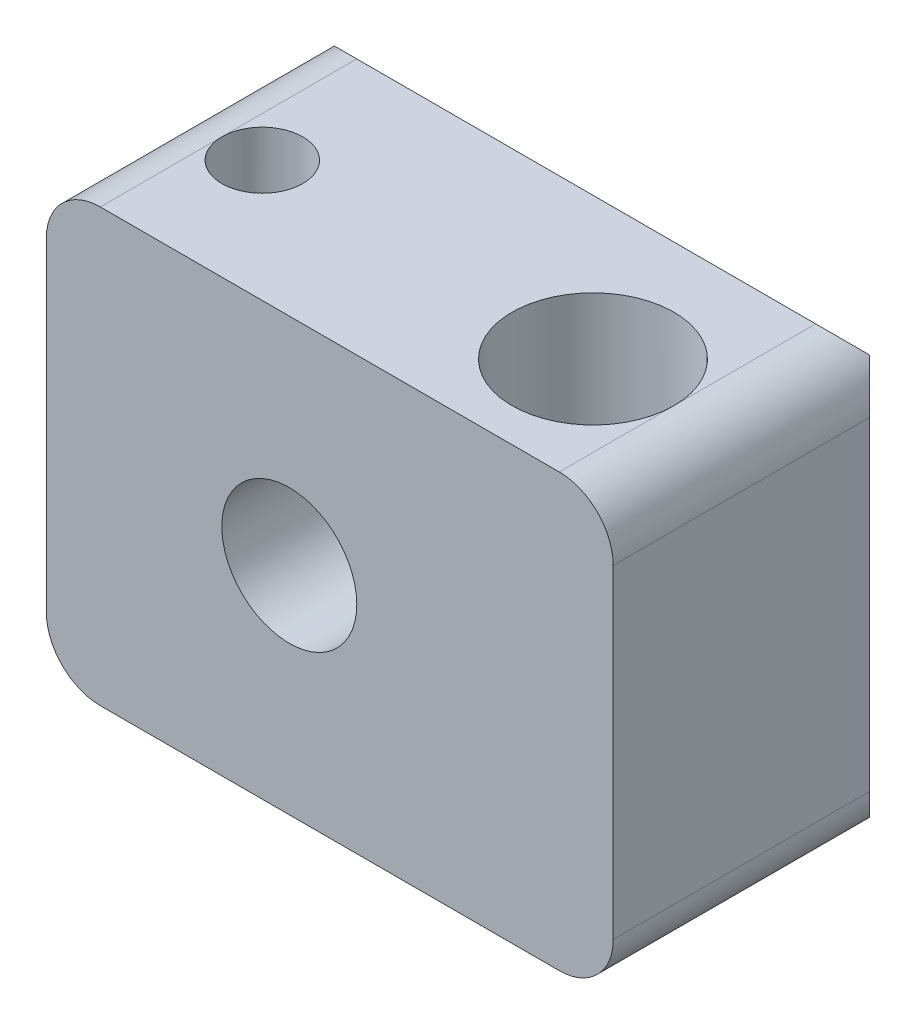
ISO-10303-21;
HEADER;
FILE_DESCRIPTION(('STEP AP214'),'2;1');
FILE_NAME('part.step','',(''),(''),'','','');
FILE_SCHEMA(('AUTOMOTIVE_DESIGN { 1 0 10303 214 1 1 1 1 }'));
ENDSEC;
DATA;
#1=APPLICATION_CONTEXT('core data for automotive mechanical design processes');
#2=APPLICATION_PROTOCOL_DEFINITION('international standard','automotive_design',2000,#1);
#3=PRODUCT_CONTEXT('',#1,'mechanical');
#4=PRODUCT('Part','Part','',(#3));
#5=PRODUCT_RELATED_PRODUCT_CATEGORY('part','',(#4));
#6=PRODUCT_DEFINITION_FORMATION('','',#4);
#7=PRODUCT_DEFINITION_CONTEXT('part definition',#1,'design');
#8=PRODUCT_DEFINITION('design','',#6,#7);
#9=PRODUCT_DEFINITION_SHAPE('','',#8);
#10=(LENGTH_UNIT() NAMED_UNIT(*) SI_UNIT(.MILLI.,.METRE.));
#11=(NAMED_UNIT(*) PLANE_ANGLE_UNIT() SI_UNIT($,.RADIAN.));
#12=(NAMED_UNIT(*) SI_UNIT($,.STERADIAN.) SOLID_ANGLE_UNIT());
#13=UNCERTAINTY_MEASURE_WITH_UNIT(LENGTH_MEASURE(1.E-05),#10,'distance_accuracy_value','');
#14=(GEOMETRIC_REPRESENTATION_CONTEXT(3) GLOBAL_UNCERTAINTY_ASSIGNED_CONTEXT((#13)) GLOBAL_UNIT_ASSIGNED_CONTEXT((#10,
#11,#12)) REPRESENTATION_CONTEXT('',''));
#15=CARTESIAN_POINT('',(0.,0.,0.));
#16=DIRECTION('',(0.,0.,1.));
#17=DIRECTION('',(1.,0.,0.));
#18=AXIS2_PLACEMENT_3D('',#15,#16,#17);
#19=CARTESIAN_POINT('',(-10.5,8.,11.5));
#20=DIRECTION('',(-1.,0.,0.));
#21=DIRECTION('',(0.,-1.,0.));
#22=AXIS2_PLACEMENT_3D('',#19,#20,#21);
#23=PLANE('',#22);
#24=DIRECTION('',(0.,-1.,0.));
#25=VECTOR('',#24,1.);
#26=CARTESIAN_POINT('',(-10.5,8.,2.00000000000001));
#27=LINE('',#26,#25);
#28=CARTESIAN_POINT('',(-10.5,6.,2.00000000000001));
#29=VERTEX_POINT('',#28);
#30=CARTESIAN_POINT('',(-10.5,-6.,2.00000000000001));
#31=VERTEX_POINT('',#30);
#32=EDGE_CURVE('E174',#29,#31,#27,.T.);
#33=ORIENTED_EDGE('',*,*,#32,.T.);
#34=DIRECTION('',(0.,0.,-1.));
#35=VECTOR('',#34,1.);
#36=CARTESIAN_POINT('',(-10.5,-6.,11.5));
#37=LINE('',#36,#35);
#38=CARTESIAN_POINT('',(-10.5,-6.,11.5));
#39=VERTEX_POINT('',#38);
#40=EDGE_CURVE('E11',#31,#39,#37,.F.);
#41=ORIENTED_EDGE('',*,*,#40,.T.);
#42=DIRECTION('',(0.,1.,0.));
#43=VECTOR('',#42,1.);
#44=CARTESIAN_POINT('',(-10.5,8.,11.5));
#45=LINE('',#44,#43);
#46=CARTESIAN_POINT('',(-10.5,6.,11.5));
#47=VERTEX_POINT('',#46);
#48=EDGE_CURVE('E231',#39,#47,#45,.T.);
#49=ORIENTED_EDGE('',*,*,#48,.T.);
#50=DIRECTION('',(0.,0.,-1.));
#51=VECTOR('',#50,1.);
#52=CARTESIAN_POINT('',(-10.5,6.,11.5));
#53=LINE('',#52,#51);
#54=EDGE_CURVE('E40',#47,#29,#53,.T.);
#55=ORIENTED_EDGE('',*,*,#54,.T.);
#56=EDGE_LOOP('',(#33,#41,#49,#55));
#57=FACE_BOUND('',#56,.T.);
#58=ADVANCED_FACE('F32',(#57),#23,.T.);
#59=CARTESIAN_POINT('',(10.5,-8.,11.5));
#60=DIRECTION('',(0.,-1.,0.));
#61=DIRECTION('',(0.,0.,-1.));
#62=AXIS2_PLACEMENT_3D('',#59,#60,#61);
#63=PLANE('',#62);
#64=DIRECTION('',(1.,0.,0.));
#65=VECTOR('',#64,1.);
#66=CARTESIAN_POINT('',(10.5,-8.,2.00000000000001));
#67=LINE('',#66,#65);
#68=CARTESIAN_POINT('',(-8.49999999999999,-8.,2.00000000000001));
#69=VERTEX_POINT('',#68);
#70=CARTESIAN_POINT('',(8.49999999999999,-8.,2.00000000000001));
#71=VERTEX_POINT('',#70);
#72=EDGE_CURVE('E171',#69,#71,#67,.T.);
#73=ORIENTED_EDGE('',*,*,#72,.T.);
#74=DIRECTION('',(0.,0.,-1.));
#75=VECTOR('',#74,1.);
#76=CARTESIAN_POINT('',(8.49999999999999,-8.,11.5));
#77=LINE('',#76,#75);
#78=CARTESIAN_POINT('',(8.49999999999999,-8.00000000000001,7.25));
#79=VERTEX_POINT('',#78);
#80=EDGE_CURVE('E224',#71,#79,#77,.F.);
#81=ORIENTED_EDGE('',*,*,#80,.T.);
#82=CARTESIAN_POINT('',(5.49999999999999,-8.00000000000001,7.25));
#83=DIRECTION('',(0.,1.,0.));
#84=DIRECTION('',(0.,0.,1.));
#85=AXIS2_PLACEMENT_3D('',#82,#83,#84);
#86=CIRCLE('',#85,3.);
#87=EDGE_CURVE('E255',#79,#79,#86,.T.);
#88=ORIENTED_EDGE('',*,*,#87,.T.);
#89=DIRECTION('',(0.,0.,-1.));
#90=VECTOR('',#89,1.);
#91=CARTESIAN_POINT('',(8.49999999999999,-8.,11.5));
#92=LINE('',#91,#90);
#93=CARTESIAN_POINT('',(8.49999999999999,-8.,11.5));
#94=VERTEX_POINT('',#93);
#95=EDGE_CURVE('E222',#79,#94,#92,.F.);
#96=ORIENTED_EDGE('',*,*,#95,.T.);
#97=DIRECTION('',(-1.,0.,0.));
#98=VECTOR('',#97,1.);
#99=CARTESIAN_POINT('',(10.5,-8.,11.5));
#100=LINE('',#99,#98);
#101=CARTESIAN_POINT('',(-8.49999999999999,-8.,11.5));
#102=VERTEX_POINT('',#101);
#103=EDGE_CURVE('E158',#94,#102,#100,.T.);
#104=ORIENTED_EDGE('',*,*,#103,.T.);
#105=DIRECTION('',(0.,0.,-1.));
#106=VECTOR('',#105,1.);
#107=CARTESIAN_POINT('',(-8.49999999999999,-8.,11.5));
#108=LINE('',#107,#106);
#109=CARTESIAN_POINT('',(-8.49999999999999,-7.99999999999999,7.));
#110=VERTEX_POINT('',#109);
#111=EDGE_CURVE('E219',#102,#110,#108,.T.);
#112=ORIENTED_EDGE('',*,*,#111,.T.);
#113=CARTESIAN_POINT('',(-7.,-7.99999999999999,7.));
#114=DIRECTION('',(0.,-1.,0.));
#115=DIRECTION('',(0.,0.,-1.));
#116=AXIS2_PLACEMENT_3D('',#113,#114,#115);
#117=CIRCLE('',#116,1.49999999999999);
#118=EDGE_CURVE('E295',#110,#110,#117,.T.);
#119=ORIENTED_EDGE('',*,*,#118,.F.);
#120=DIRECTION('',(0.,0.,-1.));
#121=VECTOR('',#120,1.);
#122=CARTESIAN_POINT('',(-8.49999999999999,-8.,11.5));
#123=LINE('',#122,#121);
#124=EDGE_CURVE('E217',#110,#69,#123,.T.);
#125=ORIENTED_EDGE('',*,*,#124,.T.);
#126=EDGE_LOOP('',(#73,#81,#88,#96,#104,#112,#119,#125));
#127=FACE_BOUND('',#126,.T.);
#128=ADVANCED_FACE('F324',(#127),#63,.T.);
#129=CARTESIAN_POINT('',(10.5,8.,11.5));
#130=DIRECTION('',(1.,0.,0.));
#131=DIRECTION('',(0.,1.,0.));
#132=AXIS2_PLACEMENT_3D('',#129,#130,#131);
#133=PLANE('',#132);
#134=DIRECTION('',(0.,1.,0.));
#135=VECTOR('',#134,1.);
#136=CARTESIAN_POINT('',(10.5,8.,2.00000000000001));
#137=LINE('',#136,#135);
#138=CARTESIAN_POINT('',(10.5,-6.,2.00000000000001));
#139=VERTEX_POINT('',#138);
#140=CARTESIAN_POINT('',(10.5,6.,2.00000000000001));
#141=VERTEX_POINT('',#140);
#142=EDGE_CURVE('E168',#139,#141,#137,.T.);
#143=ORIENTED_EDGE('',*,*,#142,.T.);
#144=DIRECTION('',(0.,0.,-1.));
#145=VECTOR('',#144,1.);
#146=CARTESIAN_POINT('',(10.5,6.,11.5));
#147=LINE('',#146,#145);
#148=CARTESIAN_POINT('',(10.5,6.,11.5));
#149=VERTEX_POINT('',#148);
#150=EDGE_CURVE('E203',#141,#149,#147,.F.);
#151=ORIENTED_EDGE('',*,*,#150,.T.);
#152=DIRECTION('',(0.,-1.,0.));
#153=VECTOR('',#152,1.);
#154=CARTESIAN_POINT('',(10.5,8.,11.5));
#155=LINE('',#154,#153);
#156=CARTESIAN_POINT('',(10.5,-6.,11.5));
#157=VERTEX_POINT('',#156);
#158=EDGE_CURVE('E161',#149,#157,#155,.T.);
#159=ORIENTED_EDGE('',*,*,#158,.T.);
#160=DIRECTION('',(0.,0.,-1.));
#161=VECTOR('',#160,1.);
#162=CARTESIAN_POINT('',(10.5,-6.,11.5));
#163=LINE('',#162,#161);
#164=EDGE_CURVE('E200',#157,#139,#163,.T.);
#165=ORIENTED_EDGE('',*,*,#164,.T.);
#166=EDGE_LOOP('',(#143,#151,#159,#165));
#167=FACE_BOUND('',#166,.T.);
#168=ADVANCED_FACE('F321',(#167),#133,.T.);
#169=CARTESIAN_POINT('',(-10.5,8.,11.5));
#170=DIRECTION('',(0.,1.,0.));
#171=DIRECTION('',(0.,0.,1.));
#172=AXIS2_PLACEMENT_3D('',#169,#170,#171);
#173=PLANE('',#172);
#174=DIRECTION('',(1.,0.,0.));
#175=VECTOR('',#174,1.);
#176=CARTESIAN_POINT('',(-10.5,8.,11.5));
#177=LINE('',#176,#175);
#178=CARTESIAN_POINT('',(-8.49999999999999,8.,11.5));
#179=VERTEX_POINT('',#178);
#180=CARTESIAN_POINT('',(8.49999999999999,8.,11.5));
#181=VERTEX_POINT('',#180);
#182=EDGE_CURVE('E241',#179,#181,#177,.T.);
#183=ORIENTED_EDGE('',*,*,#182,.T.);
#184=DIRECTION('',(0.,0.,-1.));
#185=VECTOR('',#184,1.);
#186=CARTESIAN_POINT('',(8.49999999999999,8.,11.5));
#187=LINE('',#186,#185);
#188=CARTESIAN_POINT('',(8.49999999999999,7.99999999999999,7.25));
#189=VERTEX_POINT('',#188);
#190=EDGE_CURVE('E189',#181,#189,#187,.T.);
#191=ORIENTED_EDGE('',*,*,#190,.T.);
#192=CARTESIAN_POINT('',(5.49999999999999,7.99999999999999,7.25));
#193=DIRECTION('',(0.,1.,0.));
#194=DIRECTION('',(0.,0.,1.));
#195=AXIS2_PLACEMENT_3D('',#192,#193,#194);
#196=CIRCLE('',#195,3.);
#197=EDGE_CURVE('E258',#189,#189,#196,.T.);
#198=ORIENTED_EDGE('',*,*,#197,.F.);
#199=DIRECTION('',(0.,0.,-1.));
#200=VECTOR('',#199,1.);
#201=CARTESIAN_POINT('',(8.49999999999999,8.,11.5));
#202=LINE('',#201,#200);
#203=CARTESIAN_POINT('',(8.49999999999999,8.,2.00000000000001));
#204=VERTEX_POINT('',#203);
#205=EDGE_CURVE('E187',#189,#204,#202,.T.);
#206=ORIENTED_EDGE('',*,*,#205,.T.);
#207=DIRECTION('',(-1.,0.,0.));
#208=VECTOR('',#207,1.);
#209=CARTESIAN_POINT('',(-10.5,8.,2.00000000000001));
#210=LINE('',#209,#208);
#211=CARTESIAN_POINT('',(-8.49999999999999,8.,2.00000000000001));
#212=VERTEX_POINT('',#211);
#213=EDGE_CURVE('E176',#204,#212,#210,.T.);
#214=ORIENTED_EDGE('',*,*,#213,.T.);
#215=DIRECTION('',(0.,0.,-1.));
#216=VECTOR('',#215,1.);
#217=CARTESIAN_POINT('',(-8.49999999999999,8.,11.5));
#218=LINE('',#217,#216);
#219=CARTESIAN_POINT('',(-8.49999999999999,8.00000000000002,7.));
#220=VERTEX_POINT('',#219);
#221=EDGE_CURVE('E185',#212,#220,#218,.F.);
#222=ORIENTED_EDGE('',*,*,#221,.T.);
#223=CARTESIAN_POINT('',(-7.,8.00000000000002,7.));
#224=DIRECTION('',(0.,-1.,0.));
#225=DIRECTION('',(0.,0.,-1.));
#226=AXIS2_PLACEMENT_3D('',#223,#224,#225);
#227=CIRCLE('',#226,1.49999999999999);
#228=EDGE_CURVE('E297',#220,#220,#227,.T.);
#229=ORIENTED_EDGE('',*,*,#228,.T.);
#230=DIRECTION('',(0.,0.,-1.));
#231=VECTOR('',#230,1.);
#232=CARTESIAN_POINT('',(-8.49999999999999,8.,11.5));
#233=LINE('',#232,#231);
#234=EDGE_CURVE('E179',#220,#179,#233,.F.);
#235=ORIENTED_EDGE('',*,*,#234,.T.);
#236=EDGE_LOOP('',(#183,#191,#198,#206,#214,#222,#229,#235));
#237=FACE_BOUND('',#236,.T.);
#238=ADVANCED_FACE('F316',(#237),#173,.T.);
#239=CARTESIAN_POINT('',(0.,0.,11.5));
#240=DIRECTION('',(0.,0.,-1.));
#241=DIRECTION('',(-1.,0.,0.));
#242=AXIS2_PLACEMENT_3D('',#239,#240,#241);
#243=PLANE('',#242);
#244=CARTESIAN_POINT('',(-1.50000000000001,0.,11.5));
#245=DIRECTION('',(0.,0.,1.));
#246=DIRECTION('',(1.,0.,0.));
#247=AXIS2_PLACEMENT_3D('',#244,#245,#246);
#248=CIRCLE('',#247,2.49999999999999);
#249=CARTESIAN_POINT('',(0.999999999999978,0.,11.5));
#250=VERTEX_POINT('',#249);
#251=EDGE_CURVE('E252',#250,#250,#248,.T.);
#252=ORIENTED_EDGE('',*,*,#251,.F.);
#253=EDGE_LOOP('',(#252));
#254=FACE_BOUND('',#253,.T.);
#255=ORIENTED_EDGE('',*,*,#158,.F.);
#256=CARTESIAN_POINT('',(8.49999999999999,6.,11.5));
#257=DIRECTION('',(0.,0.,-1.));
#258=DIRECTION('',(-1.,0.,0.));
#259=AXIS2_PLACEMENT_3D('',#256,#257,#258);
#260=CIRCLE('',#259,2.);
#261=EDGE_CURVE('E211',#149,#181,#260,.F.);
#262=ORIENTED_EDGE('',*,*,#261,.T.);
#263=ORIENTED_EDGE('',*,*,#182,.F.);
#264=CARTESIAN_POINT('',(-8.49999999999999,6.,11.5));
#265=DIRECTION('',(0.,0.,-1.));
#266=DIRECTION('',(-1.,0.,0.));
#267=AXIS2_PLACEMENT_3D('',#264,#265,#266);
#268=CIRCLE('',#267,2.);
#269=EDGE_CURVE('E205',#179,#47,#268,.F.);
#270=ORIENTED_EDGE('',*,*,#269,.T.);
#271=ORIENTED_EDGE('',*,*,#48,.F.);
#272=CARTESIAN_POINT('',(-8.49999999999999,-6.,11.5));
#273=DIRECTION('',(0.,0.,-1.));
#274=DIRECTION('',(-1.,0.,0.));
#275=AXIS2_PLACEMENT_3D('',#272,#273,#274);
#276=CIRCLE('',#275,2.);
#277=EDGE_CURVE('E207',#39,#102,#276,.F.);
#278=ORIENTED_EDGE('',*,*,#277,.T.);
#279=ORIENTED_EDGE('',*,*,#103,.F.);
#280=CARTESIAN_POINT('',(8.49999999999999,-6.,11.5));
#281=DIRECTION('',(0.,0.,-1.));
#282=DIRECTION('',(-1.,0.,0.));
#283=AXIS2_PLACEMENT_3D('',#280,#281,#282);
#284=CIRCLE('',#283,2.);
#285=EDGE_CURVE('E209',#94,#157,#284,.F.);
#286=ORIENTED_EDGE('',*,*,#285,.T.);
#287=EDGE_LOOP('',(#255,#262,#263,#270,#271,#278,#279,#286));
#288=FACE_BOUND('',#287,.T.);
#289=ADVANCED_FACE('F238',(#254,#288),#243,.F.);
#290=CARTESIAN_POINT('',(0.,0.,0.));
#291=DIRECTION('',(0.,0.,-1.));
#292=DIRECTION('',(-1.,0.,0.));
#293=AXIS2_PLACEMENT_3D('',#290,#291,#292);
#294=PLANE('',#293);
#295=DIRECTION('',(1.,0.,0.));
#296=VECTOR('',#295,1.);
#297=CARTESIAN_POINT('',(0.,5.99999999999999,0.));
#298=LINE('',#297,#296);
#299=CARTESIAN_POINT('',(-8.49999999999999,5.99999999999999,0.));
#300=VERTEX_POINT('',#299);
#301=CARTESIAN_POINT('',(8.49999999999999,5.99999999999999,0.));
#302=VERTEX_POINT('',#301);
#303=EDGE_CURVE('E141',#300,#302,#298,.T.);
#304=ORIENTED_EDGE('',*,*,#303,.T.);
#305=DIRECTION('',(0.,-1.,0.));
#306=VECTOR('',#305,1.);
#307=CARTESIAN_POINT('',(8.49999999999999,0.,0.));
#308=LINE('',#307,#306);
#309=CARTESIAN_POINT('',(8.49999999999999,-5.99999999999999,0.));
#310=VERTEX_POINT('',#309);
#311=EDGE_CURVE('E166',#302,#310,#308,.T.);
#312=ORIENTED_EDGE('',*,*,#311,.T.);
#313=DIRECTION('',(-1.,0.,0.));
#314=VECTOR('',#313,1.);
#315=CARTESIAN_POINT('',(0.,-5.99999999999999,0.));
#316=LINE('',#315,#314);
#317=CARTESIAN_POINT('',(-8.49999999999999,-5.99999999999999,0.));
#318=VERTEX_POINT('',#317);
#319=EDGE_CURVE('E144',#310,#318,#316,.T.);
#320=ORIENTED_EDGE('',*,*,#319,.T.);
#321=DIRECTION('',(0.,1.,0.));
#322=VECTOR('',#321,1.);
#323=CARTESIAN_POINT('',(-8.49999999999999,0.,0.));
#324=LINE('',#323,#322);
#325=EDGE_CURVE('E135',#318,#300,#324,.T.);
#326=ORIENTED_EDGE('',*,*,#325,.T.);
#327=EDGE_LOOP('',(#304,#312,#320,#326));
#328=FACE_BOUND('',#327,.T.);
#329=CARTESIAN_POINT('',(-7.,0.,0.));
#330=DIRECTION('',(0.,0.,-1.));
#331=DIRECTION('',(-1.,0.,0.));
#332=AXIS2_PLACEMENT_3D('',#329,#330,#331);
#333=CIRCLE('',#332,1.24999999999999);
#334=CARTESIAN_POINT('',(-8.24999999999998,0.,0.));
#335=VERTEX_POINT('',#334);
#336=EDGE_CURVE('E150',#335,#335,#333,.T.);
#337=ORIENTED_EDGE('',*,*,#336,.F.);
#338=EDGE_LOOP('',(#337));
#339=FACE_BOUND('',#338,.T.);
#340=CARTESIAN_POINT('',(5.49999999999999,0.,0.));
#341=DIRECTION('',(0.,0.,-1.));
#342=DIRECTION('',(-1.,0.,0.));
#343=AXIS2_PLACEMENT_3D('',#340,#341,#342);
#344=CIRCLE('',#343,1.24999999999999);
#345=CARTESIAN_POINT('',(4.25,0.,0.));
#346=VERTEX_POINT('',#345);
#347=EDGE_CURVE('E269',#346,#346,#344,.T.);
#348=ORIENTED_EDGE('',*,*,#347,.F.);
#349=EDGE_LOOP('',(#348));
#350=FACE_BOUND('',#349,.T.);
#351=CARTESIAN_POINT('',(-1.50000000000001,0.,0.));
#352=DIRECTION('',(0.,0.,1.));
#353=DIRECTION('',(1.,0.,0.));
#354=AXIS2_PLACEMENT_3D('',#351,#352,#353);
#355=CIRCLE('',#354,2.49999999999999);
#356=CARTESIAN_POINT('',(0.999999999999976,0.,0.));
#357=VERTEX_POINT('',#356);
#358=EDGE_CURVE('E247',#357,#357,#355,.T.);
#359=ORIENTED_EDGE('',*,*,#358,.T.);
#360=EDGE_LOOP('',(#359));
#361=FACE_BOUND('',#360,.T.);
#362=ADVANCED_FACE('F137',(#328,#339,#350,#361),#294,.T.);
#363=CARTESIAN_POINT('',(-1.50000000000001,0.,11.5));
#364=DIRECTION('',(0.,0.,1.));
#365=DIRECTION('',(1.,0.,0.));
#366=AXIS2_PLACEMENT_3D('',#363,#364,#365);
#367=CYLINDRICAL_SURFACE('',#366,2.49999999999999);
#368=ORIENTED_EDGE('',*,*,#358,.F.);
#369=EDGE_LOOP('',(#368));
#370=FACE_BOUND('',#369,.T.);
#371=ORIENTED_EDGE('',*,*,#251,.T.);
#372=EDGE_LOOP('',(#371));
#373=FACE_BOUND('',#372,.T.);
#374=ADVANCED_FACE('F306',(#370,#373),#367,.F.);
#375=CARTESIAN_POINT('',(5.49999999999999,7.99999999999999,7.25));
#376=DIRECTION('',(0.,1.,0.));
#377=DIRECTION('',(0.,0.,1.));
#378=AXIS2_PLACEMENT_3D('',#375,#376,#377);
#379=CYLINDRICAL_SURFACE('',#378,3.);
#380=CARTESIAN_POINT('',(4.25,0.,4.52282197134107));
#381=CARTESIAN_POINT('',(4.25000740933432,0.066671890896854,4.52281480436781));
#382=CARTESIAN_POINT('',(4.25536796118497,0.133452656826216,4.520341404656));
#383=CARTESIAN_POINT('',(4.27660321052215,0.265086942057142,4.51076166349116));
#384=CARTESIAN_POINT('',(4.29250645996723,0.329934726675235,4.50364274175733));
#385=CARTESIAN_POINT('',(4.33410011580549,0.455561129691073,4.48573082425232));
#386=CARTESIAN_POINT('',(4.35975062568572,0.516355163715015,4.47495282437384));
#387=CARTESIAN_POINT('',(4.41999362245537,0.632759449578051,4.45095851434207));
#388=CARTESIAN_POINT('',(4.45458399408468,0.688370923433118,4.43774278119217));
#389=CARTESIAN_POINT('',(4.53402611732383,0.796325724973467,4.40944237380143));
#390=CARTESIAN_POINT('',(4.57934676181559,0.848307558744089,4.39429431920854));
#391=CARTESIAN_POINT('',(4.67797832425445,0.944200222497552,4.36435704627773));
#392=CARTESIAN_POINT('',(4.73129230862599,0.988107940613007,4.34956796819211));
#393=CARTESIAN_POINT('',(4.84723660620265,1.06844953087927,4.32124462069387));
#394=CARTESIAN_POINT('',(4.91017070631633,1.10447662803234,4.30779260024709));
#395=CARTESIAN_POINT('',(5.04186797763764,1.1652760205056,4.28443480006574));
#396=CARTESIAN_POINT('',(5.11062854512787,1.19005331196421,4.27452744652843));
#397=CARTESIAN_POINT('',(5.24823150197483,1.22633945875673,4.25982478957634));
#398=CARTESIAN_POINT('',(5.31688342380391,1.23847169490204,4.25479028872534));
#399=CARTESIAN_POINT('',(5.45542081963499,1.25113764115985,4.24953171388796));
#400=CARTESIAN_POINT('',(5.52530578176451,1.25167605588295,4.24930568868985));
#401=CARTESIAN_POINT('',(5.65979278011256,1.24146571906667,4.25354870866944));
#402=CARTESIAN_POINT('',(5.7244574886073,1.23140189947427,4.25773285351336));
#403=CARTESIAN_POINT('',(5.85108289393145,1.20144689736183,4.26993483249691));
#404=CARTESIAN_POINT('',(5.9130433910549,1.18155499036983,4.27795294925423));
#405=CARTESIAN_POINT('',(6.03363811807751,1.13227195910535,4.29720147585971));
#406=CARTESIAN_POINT('',(6.09220717707489,1.10274053712917,4.30847902873915));
#407=CARTESIAN_POINT('',(6.20371176728195,1.03515424329965,4.33314286010195));
#408=CARTESIAN_POINT('',(6.25664529775696,0.997096359155009,4.34652988333745));
#409=CARTESIAN_POINT('',(6.35934091170791,0.910417579595379,4.37518301222939));
#410=CARTESIAN_POINT('',(6.40861643731623,0.861241208720989,4.39051505643991));
#411=CARTESIAN_POINT('',(6.49843141492765,0.755288559293416,4.4206213931853));
#412=CARTESIAN_POINT('',(6.5389674958243,0.698509361707904,4.4353954686863));
#413=CARTESIAN_POINT('',(6.61140189250062,0.576604963338086,4.46318387644662));
#414=CARTESIAN_POINT('',(6.64297253355539,0.511266794256716,4.47612441443286));
#415=CARTESIAN_POINT('',(6.6944643205839,0.375518955025499,4.49790155778989));
#416=CARTESIAN_POINT('',(6.71439379627312,0.305112951730453,4.50674109665406));
#417=CARTESIAN_POINT('',(6.7408002516812,0.166103191085999,4.51858787480277));
#418=CARTESIAN_POINT('',(6.74806614632864,0.0976788777409488,4.52193630802883));
#419=CARTESIAN_POINT('',(6.75125630518997,-0.0394784824115004,4.52339713189358));
#420=CARTESIAN_POINT('',(6.74718449318148,-0.108211414191711,4.52151133400681));
#421=CARTESIAN_POINT('',(6.72853477565554,-0.239398385430446,4.51306868654251));
#422=CARTESIAN_POINT('',(6.71464618818047,-0.3019726867868,4.50681861983382));
#423=CARTESIAN_POINT('',(6.67767058564224,-0.423851296497869,4.49074369702553));
#424=CARTESIAN_POINT('',(6.65458142053123,-0.483154836830707,4.48091800539839));
#425=CARTESIAN_POINT('',(6.59877520805185,-0.599615310356466,4.45829202143));
#426=CARTESIAN_POINT('',(6.56569183306196,-0.65657497461032,4.44538337797718));
#427=CARTESIAN_POINT('',(6.49120078438595,-0.764408052499017,4.41819996259206));
#428=CARTESIAN_POINT('',(6.44978950787597,-0.815278816701864,4.40392460079417));
#429=CARTESIAN_POINT('',(6.35584445571549,-0.913800134884,4.37421380215468));
#430=CARTESIAN_POINT('',(6.30267966147972,-0.960851399950653,4.35877853291158));
#431=CARTESIAN_POINT('',(6.18885151255352,-1.04547229197932,4.32956638816077));
#432=CARTESIAN_POINT('',(6.12818760880364,-1.08304122406369,4.31578963422987));
#433=CARTESIAN_POINT('',(6.00065468080337,-1.14758987544357,4.2913574841435));
#434=CARTESIAN_POINT('',(5.93377016963849,-1.17454224128947,4.28071016861174));
#435=CARTESIAN_POINT('',(5.7958588351544,-1.21661679233442,4.26381826896634));
#436=CARTESIAN_POINT('',(5.72483450422518,-1.23174601822606,4.2575710648008));
#437=CARTESIAN_POINT('',(5.5860165335064,-1.2488581255203,4.2504846520249));
#438=CARTESIAN_POINT('',(5.51834408479389,-1.25168599969696,4.24929795465775));
#439=CARTESIAN_POINT('',(5.3835131882857,-1.24638685870605,4.25150476519048));
#440=CARTESIAN_POINT('',(5.31635465245883,-1.23826176398712,4.25489747015687));
#441=CARTESIAN_POINT('',(5.1869135175508,-1.21189392784133,4.26569934018266));
#442=CARTESIAN_POINT('',(5.12454246215642,-1.19402031953044,4.27296175790767));
#443=CARTESIAN_POINT('',(5.00370776949866,-1.14906575279086,4.29070500152942));
#444=CARTESIAN_POINT('',(4.94524487701416,-1.12198304533509,4.30118643875794));
#445=CARTESIAN_POINT('',(4.83097543452121,-1.05801047078553,4.32494174601338));
#446=CARTESIAN_POINT('',(4.77540834202331,-1.020732698576,4.33832040811235));
#447=CARTESIAN_POINT('',(4.67108132436121,-0.9379928171281,4.36628438125769));
#448=CARTESIAN_POINT('',(4.62232393821395,-0.892527669593243,4.38087013916203));
#449=CARTESIAN_POINT('',(4.52955021276841,-0.791055174145589,4.41085154740859));
#450=CARTESIAN_POINT('',(4.48608224635152,-0.734540985378873,4.42623477142104));
#451=CARTESIAN_POINT('',(4.40916667693325,-0.6145412593198,4.45504447309814));
#452=CARTESIAN_POINT('',(4.37572467543245,-0.551051851941851,4.46846985477442));
#453=CARTESIAN_POINT('',(4.32017233956422,-0.419056164977243,4.49157442267358));
#454=CARTESIAN_POINT('',(4.29800176367146,-0.350578841206786,4.50127345530135));
#455=CARTESIAN_POINT('',(4.26576443546199,-0.210460426149327,4.51559196933333));
#456=CARTESIAN_POINT('',(4.2556570847879,-0.138830792725696,4.52022848395019));
#457=CARTESIAN_POINT('',(4.2505953507635,-0.04464147573811,4.52255020267312));
#458=CARTESIAN_POINT('',(4.24999751878881,-0.0223268426119629,4.52282437139126));
#459=CARTESIAN_POINT('',(4.25,0.,4.52282197134107));
#460=B_SPLINE_CURVE_WITH_KNOTS('',3,(#380,#381,#382,#383,#384,#385,#386,#387,#388,#389,#390,
#391,#392,#393,#394,#395,#396,#397,#398,#399,#400,#401,#402,#403,#404,#405,#406,#407,#408,#409,
#410,#411,#412,#413,#414,#415,#416,#417,#418,#419,#420,#421,#422,#423,#424,#425,#426,#427,#428,
#429,#430,#431,#432,#433,#434,#435,#436,#437,#438,#439,#440,#441,#442,#443,#444,#445,#446,#447,
#448,#449,#450,#451,#452,#453,#454,#455,#456,#457,#458,#459),.UNSPECIFIED.,.T.,.F.,(4,2,2,2,2,2,
2,2,2,2,2,2,2,2,2,2,2,2,2,2,2,2,2,2,2,2,2,2,2,2,2,2,2,2,2,2,2,2,2,4),(0.,0.199951711985514,
0.400447161842174,0.600130652152109,0.799766938550096,1.01066841430653,1.2216510045991,
1.44178476577923,1.6618206677489,1.87040605977951,2.07890680917929,2.27471840245092,
2.47054443201882,2.66935814640064,2.86824221022483,3.08114531844483,3.29413040441365,
3.5141154566672,3.73394290745567,3.93950778306305,4.14500152518446,4.3373390106619,
4.52972146913527,4.73025126818167,4.93086800795463,5.14781662735511,5.36478114041864,
5.58230105955592,5.79969134643004,6.00188635094051,6.20404590801911,6.39903415036485,
6.59405944632169,6.79789862829033,7.00181361048901,7.21960426908074,7.43751638139185,
7.65425125796861,7.87025464546159,7.93721375436701),.UNSPECIFIED.);
#461=CARTESIAN_POINT('',(4.25,0.,4.52282197134107));
#462=VERTEX_POINT('',#461);
#463=EDGE_CURVE('E261',#462,#462,#460,.T.);
#464=ORIENTED_EDGE('',*,*,#463,.T.);
#465=EDGE_LOOP('',(#464));
#466=FACE_BOUND('',#465,.T.);
#467=ORIENTED_EDGE('',*,*,#87,.F.);
#468=EDGE_LOOP('',(#467));
#469=FACE_BOUND('',#468,.T.);
#470=ORIENTED_EDGE('',*,*,#197,.T.);
#471=EDGE_LOOP('',(#470));
#472=FACE_BOUND('',#471,.T.);
#473=ADVANCED_FACE('F278',(#466,#469,#472),#379,.F.);
#474=CARTESIAN_POINT('',(5.49999999999999,0.,0.));
#475=DIRECTION('',(0.,0.,-1.));
#476=DIRECTION('',(-1.,0.,0.));
#477=AXIS2_PLACEMENT_3D('',#474,#475,#476);
#478=CYLINDRICAL_SURFACE('',#477,1.24999999999999);
#479=ORIENTED_EDGE('',*,*,#463,.F.);
#480=EDGE_LOOP('',(#479));
#481=FACE_BOUND('',#480,.T.);
#482=ORIENTED_EDGE('',*,*,#347,.T.);
#483=EDGE_LOOP('',(#482));
#484=FACE_BOUND('',#483,.T.);
#485=ADVANCED_FACE('F273',(#481,#484),#478,.F.);
#486=CARTESIAN_POINT('',(-7.,-7.99999999999999,7.));
#487=DIRECTION('',(0.,-1.,0.));
#488=DIRECTION('',(0.,0.,-1.));
#489=AXIS2_PLACEMENT_3D('',#486,#487,#488);
#490=CYLINDRICAL_SURFACE('',#489,1.49999999999999);
#491=CARTESIAN_POINT('',(-7.,1.24999999999999,5.50000000000001));
#492=CARTESIAN_POINT('',(-6.9406212311495,1.24999755162013,5.50000239399493));
#493=CARTESIAN_POINT('',(-6.88122434292403,1.24573873608632,5.50355666693979));
#494=CARTESIAN_POINT('',(-6.76440877028973,1.22901865029432,5.51744616573043));
#495=CARTESIAN_POINT('',(-6.70699158410562,1.21655130529971,5.52778641353024));
#496=CARTESIAN_POINT('',(-6.59608496526268,1.18434389929647,5.55428662014083));
#497=CARTESIAN_POINT('',(-6.54257430250574,1.16464730700095,5.57041178205294));
#498=CARTESIAN_POINT('',(-6.44007954190494,1.1189916319036,5.60735385419266));
#499=CARTESIAN_POINT('',(-6.3910969811955,1.09303043320278,5.62817234945819));
#500=CARTESIAN_POINT('',(-6.2810487972298,1.02527232994862,5.68163039375945));
#501=CARTESIAN_POINT('',(-6.22215361531251,0.98116142459714,5.7158031569082));
#502=CARTESIAN_POINT('',(-6.11399330965836,0.884741320224273,5.78788095628663));
#503=CARTESIAN_POINT('',(-6.0647557922809,0.832409367774604,5.8257962391044));
#504=CARTESIAN_POINT('',(-5.97523018494785,0.719475666551751,5.90300452178142));
#505=CARTESIAN_POINT('',(-5.93512459285538,0.658738788995397,5.94231003270695));
#506=CARTESIAN_POINT('',(-5.86539053024662,0.529649327753202,6.01752662176215));
#507=CARTESIAN_POINT('',(-5.83573129544497,0.461319899248835,6.05344743495649));
#508=CARTESIAN_POINT('',(-5.79903190613657,0.349152321823383,6.10103329707018));
#509=CARTESIAN_POINT('',(-5.7878308230041,0.308234151359276,6.1163165462204));
#510=CARTESIAN_POINT('',(-5.76949356981688,0.224058908581064,6.14203599010774));
#511=CARTESIAN_POINT('',(-5.76234753349853,0.180807796016896,6.15248393799757));
#512=CARTESIAN_POINT('',(-5.75259460516662,0.0921161932337638,6.16689486023866));
#513=CARTESIAN_POINT('',(-5.75004399218103,0.0466554691685121,6.17077739469821));
#514=CARTESIAN_POINT('',(-5.74995713566946,-0.0442807551980052,6.17090850982791));
#515=CARTESIAN_POINT('',(-5.75242095787021,-0.089756255685141,6.16715699043468));
#516=CARTESIAN_POINT('',(-5.76247379897673,-0.182763549838962,6.15229211139436));
#517=CARTESIAN_POINT('',(-5.7704725486039,-0.230151202597591,6.14059168754303));
#518=CARTESIAN_POINT('',(-5.79128681150007,-0.322101145839491,6.1115574668342));
#519=CARTESIAN_POINT('',(-5.80411830851657,-0.366653480876659,6.09420500254405));
#520=CARTESIAN_POINT('',(-5.84277436869871,-0.478104397695269,6.04486086529176));
#521=CARTESIAN_POINT('',(-5.87180076140329,-0.542714880205952,6.01026545825776));
#522=CARTESIAN_POINT('',(-5.93928275895492,-0.665028739011629,5.93823637303842));
#523=CARTESIAN_POINT('',(-5.9777552150892,-0.722719494040696,5.90079770598453));
#524=CARTESIAN_POINT('',(-6.06616144574216,-0.834120412783262,5.82461504011131));
#525=CARTESIAN_POINT('',(-6.11658859176396,-0.887465696388271,5.78590489007203));
#526=CARTESIAN_POINT('',(-6.22758043495929,-0.985559630438891,5.7124508850417));
#527=CARTESIAN_POINT('',(-6.2881227255714,-1.03032682216838,5.67769854291227));
#528=CARTESIAN_POINT('',(-6.40294368583099,-1.09970681083109,5.62285610617043));
#529=CARTESIAN_POINT('',(-6.45513622746928,-1.12657128594301,5.60125843106812));
#530=CARTESIAN_POINT('',(-6.56446438275906,-1.17317153567639,5.56346079857644));
#531=CARTESIAN_POINT('',(-6.62159688336793,-1.19291175982446,5.54725747258114));
#532=CARTESIAN_POINT('',(-6.74002281940821,-1.22420858059788,5.52145087815962));
#533=CARTESIAN_POINT('',(-6.80134453167495,-1.23570196071462,5.51189860983531));
#534=CARTESIAN_POINT('',(-6.92572001829598,-1.24935462856929,5.50054281275042));
#535=CARTESIAN_POINT('',(-6.98877260531645,-1.25152016152219,5.49873409950094));
#536=CARTESIAN_POINT('',(-7.10665510229987,-1.24666877491131,5.50277501270705));
#537=CARTESIAN_POINT('',(-7.16156528532413,-1.24072067022761,5.50773326482081));
#538=CARTESIAN_POINT('',(-7.26932246729229,-1.2218665353103,5.52337203429477));
#539=CARTESIAN_POINT('',(-7.3221692179314,-1.20895967043913,5.53405323806802));
#540=CARTESIAN_POINT('',(-7.42528280742803,-1.1766882654871,5.56055245886816));
#541=CARTESIAN_POINT('',(-7.47550555866546,-1.15723946784766,5.57643742482088));
#542=CARTESIAN_POINT('',(-7.57182928685616,-1.11280232131271,5.61231912695756));
#543=CARTESIAN_POINT('',(-7.61792873132879,-1.08781192471689,5.63231738286274));
#544=CARTESIAN_POINT('',(-7.72533837669181,-1.0207833585351,5.68512558852998));
#545=CARTESIAN_POINT('',(-7.78417711116974,-0.976130353623678,5.71965486478462));
#546=CARTESIAN_POINT('',(-7.89213964351646,-0.878583173972347,5.79238166787316));
#547=CARTESIAN_POINT('',(-7.94123228541874,-0.825663506224446,5.83059039684529));
#548=CARTESIAN_POINT('',(-8.03033901299861,-0.711512047530351,5.90823568684894));
#549=CARTESIAN_POINT('',(-8.07017375330093,-0.650147769365961,5.94768196888398));
#550=CARTESIAN_POINT('',(-8.13922410535011,-0.51970741985195,6.02289413967484));
#551=CARTESIAN_POINT('',(-8.16847444328378,-0.450657557281175,6.05867178274804));
#552=CARTESIAN_POINT('',(-8.20418713962592,-0.337851015294563,6.10536481112295));
#553=CARTESIAN_POINT('',(-8.21494166451885,-0.297079061568736,6.12014446495474));
#554=CARTESIAN_POINT('',(-8.23241118575505,-0.213277726588102,6.1447866517065));
#555=CARTESIAN_POINT('',(-8.23913627036994,-0.170254278728853,6.15466145391229));
#556=CARTESIAN_POINT('',(-8.24808646608226,-0.082180119669023,6.16792290420276));
#557=CARTESIAN_POINT('',(-8.25025897513145,-0.0371117930515638,6.17123368600962));
#558=CARTESIAN_POINT('',(-8.24969100631608,0.0529260641759294,6.17037851561061));
#559=CARTESIAN_POINT('',(-8.24694923297195,0.0978955656051493,6.16621059190391));
#560=CARTESIAN_POINT('',(-8.23632620681834,0.190837495965955,6.15053581734844));
#561=CARTESIAN_POINT('',(-8.2279286145655,0.238619561874931,6.13829452719419));
#562=CARTESIAN_POINT('',(-8.20625214805456,0.331261206708376,6.1082049729016));
#563=CARTESIAN_POINT('',(-8.19295712996404,0.376110535798412,6.0903381935694));
#564=CARTESIAN_POINT('',(-8.15299054037421,0.488341798149978,6.03970661892045));
#565=CARTESIAN_POINT('',(-8.12305667484074,0.553381329033074,6.00437642970177));
#566=CARTESIAN_POINT('',(-8.05354944095066,0.676409635896379,5.93106891848433));
#567=CARTESIAN_POINT('',(-8.01395911755892,0.734385738286557,5.89308702521345));
#568=CARTESIAN_POINT('',(-7.92315768351135,0.845990753379604,5.81615174472758));
#569=CARTESIAN_POINT('',(-7.87147223483391,0.899267484501722,5.77724194024045));
#570=CARTESIAN_POINT('',(-7.75776534327975,0.996935304625567,5.70371360425394));
#571=CARTESIAN_POINT('',(-7.69576735808072,1.04134606754812,5.66908563772861));
#572=CARTESIAN_POINT('',(-7.57927800588109,1.10915651690688,5.61528913772977));
#573=CARTESIAN_POINT('',(-7.5269995001413,1.13501910031223,5.59443930747223));
#574=CARTESIAN_POINT('',(-7.41771978277217,1.17960948970953,5.55819251939875));
#575=CARTESIAN_POINT('',(-7.36072498671692,1.19834680009579,5.54278829963347));
#576=CARTESIAN_POINT('',(-7.25331004156425,1.22509419634337,5.52070630677559));
#577=CARTESIAN_POINT('',(-7.20342273942507,1.2343875520136,5.51298929880185));
#578=CARTESIAN_POINT('',(-7.10236135778355,1.24684119321787,5.50263537523669));
#579=CARTESIAN_POINT('',(-7.05118741140436,1.25000211062353,5.49999793625896));
#580=CARTESIAN_POINT('',(-7.,1.24999999999999,5.50000000000001));
#581=B_SPLINE_CURVE_WITH_KNOTS('',3,(#491,#492,#493,#494,#495,#496,#497,#498,#499,#500,#501,
#502,#503,#504,#505,#506,#507,#508,#509,#510,#511,#512,#513,#514,#515,#516,#517,#518,#519,#520,
#521,#522,#523,#524,#525,#526,#527,#528,#529,#530,#531,#532,#533,#534,#535,#536,#537,#538,#539,
#540,#541,#542,#543,#544,#545,#546,#547,#548,#549,#550,#551,#552,#553,#554,#555,#556,#557,#558,
#559,#560,#561,#562,#563,#564,#565,#566,#567,#568,#569,#570,#571,#572,#573,#574,#575,#576,#577,
#578,#579,#580),.UNSPECIFIED.,.T.,.F.,(4,2,2,2,2,2,2,2,2,2,2,2,2,2,2,2,2,2,2,2,2,2,2,2,2,2,2,2,
2,2,2,2,2,2,2,2,2,2,2,2,2,2,2,2,4),(0.,0.177920638407555,0.355973095513478,0.53297202679775,
0.710030824150574,0.952125893800626,1.19490321558387,1.4421737640865,1.68870989486939,
1.82361318167479,1.95818681458036,2.09439761612089,2.23061020305625,2.37816635242835,
2.52621487430061,2.76143398970634,2.99707581215808,3.24501566810453,3.49241341014751,
3.67933989515105,3.86614943036555,4.05437609196178,4.24247671173497,4.4080464187528,
4.57363598871253,4.7414456041012,4.90931733118533,5.15261089108597,5.39667010414652,
5.64512295341123,5.89275310452973,6.02641745468299,6.15974574356458,6.29460624678869,
6.42950230652132,6.57876724728635,6.72852869227181,6.9667704132834,7.20543349464886,
7.45579032126995,7.70558526561244,7.89070171070686,8.07557035570176,8.22896247938912,
8.38233879708316),.UNSPECIFIED.);
#582=CARTESIAN_POINT('',(-7.,1.24999999999999,5.50000000000001));
#583=VERTEX_POINT('',#582);
#584=EDGE_CURVE('E288',#583,#583,#581,.T.);
#585=ORIENTED_EDGE('',*,*,#584,.T.);
#586=EDGE_LOOP('',(#585));
#587=FACE_BOUND('',#586,.T.);
#588=ORIENTED_EDGE('',*,*,#228,.F.);
#589=EDGE_LOOP('',(#588));
#590=FACE_BOUND('',#589,.T.);
#591=ORIENTED_EDGE('',*,*,#118,.T.);
#592=EDGE_LOOP('',(#591));
#593=FACE_BOUND('',#592,.T.);
#594=ADVANCED_FACE('F277',(#587,#590,#593),#490,.F.);
#595=CARTESIAN_POINT('',(-7.,0.,0.));
#596=DIRECTION('',(0.,0.,-1.));
#597=DIRECTION('',(-1.,0.,0.));
#598=AXIS2_PLACEMENT_3D('',#595,#596,#597);
#599=CYLINDRICAL_SURFACE('',#598,1.24999999999999);
#600=ORIENTED_EDGE('',*,*,#584,.F.);
#601=EDGE_LOOP('',(#600));
#602=FACE_BOUND('',#601,.T.);
#603=ORIENTED_EDGE('',*,*,#336,.T.);
#604=EDGE_LOOP('',(#603));
#605=FACE_BOUND('',#604,.T.);
#606=ADVANCED_FACE('F282',(#602,#605),#599,.F.);
#607=CARTESIAN_POINT('',(-8.49999999999999,0.,0.));
#608=DIRECTION('',(0.707106781186548,0.,0.707106781186547));
#609=DIRECTION('',(0.,1.,0.));
#610=AXIS2_PLACEMENT_3D('',#607,#608,#609);
#611=PLANE('',#610);
#612=DIRECTION('',(-0.577350269189626,-0.577350269189626,0.577350269189626));
#613=VECTOR('',#612,1.);
#614=CARTESIAN_POINT('',(-6.49999999999999,-3.99999999999999,-2.));
#615=LINE('',#614,#613);
#616=CARTESIAN_POINT('',(-9.91421356237309,-7.41421356237309,1.4142135623731));
#617=VERTEX_POINT('',#616);
#618=EDGE_CURVE('E151',#617,#318,#615,.F.);
#619=ORIENTED_EDGE('',*,*,#618,.F.);
#620=CARTESIAN_POINT('',(-8.49999999999999,-6.,0.));
#621=DIRECTION('',(0.707106781186548,0.,0.707106781186547));
#622=DIRECTION('',(0.707106781186547,0.,-0.707106781186548));
#623=AXIS2_PLACEMENT_3D('',#620,#621,#622);
#624=ELLIPSE('',#623,2.82842712474619,2.);
#625=EDGE_CURVE('E47',#617,#31,#624,.F.);
#626=ORIENTED_EDGE('',*,*,#625,.T.);
#627=ORIENTED_EDGE('',*,*,#32,.F.);
#628=CARTESIAN_POINT('',(-8.49999999999999,6.,0.));
#629=DIRECTION('',(0.707106781186548,0.,0.707106781186547));
#630=DIRECTION('',(0.707106781186547,0.,-0.707106781186548));
#631=AXIS2_PLACEMENT_3D('',#628,#629,#630);
#632=ELLIPSE('',#631,2.82842712474619,2.);
#633=CARTESIAN_POINT('',(-9.91421356237309,7.41421356237309,1.4142135623731));
#634=VERTEX_POINT('',#633);
#635=EDGE_CURVE('E55',#29,#634,#632,.F.);
#636=ORIENTED_EDGE('',*,*,#635,.T.);
#637=DIRECTION('',(-0.577350269189626,0.577350269189626,0.577350269189626));
#638=VECTOR('',#637,1.);
#639=CARTESIAN_POINT('',(-5.66666666666666,3.16666666666666,-2.83333333333333));
#640=LINE('',#639,#638);
#641=EDGE_CURVE('E147',#300,#634,#640,.T.);
#642=ORIENTED_EDGE('',*,*,#641,.F.);
#643=ORIENTED_EDGE('',*,*,#325,.F.);
#644=EDGE_LOOP('',(#619,#626,#627,#636,#642,#643));
#645=FACE_BOUND('',#644,.T.);
#646=ADVANCED_FACE('F148',(#645),#611,.F.);
#647=CARTESIAN_POINT('',(0.,5.99999999999999,0.));
#648=DIRECTION('',(0.,-0.707106781186548,0.707106781186548));
#649=DIRECTION('',(1.,0.,0.));
#650=AXIS2_PLACEMENT_3D('',#647,#648,#649);
#651=PLANE('',#650);
#652=ORIENTED_EDGE('',*,*,#213,.F.);
#653=CARTESIAN_POINT('',(8.49999999999999,6.,0.));
#654=DIRECTION('',(0.,-0.707106781186548,0.707106781186548));
#655=DIRECTION('',(0.,-0.707106781186548,-0.707106781186548));
#656=AXIS2_PLACEMENT_3D('',#653,#654,#655);
#657=ELLIPSE('',#656,2.82842712474619,2.);
#658=CARTESIAN_POINT('',(9.91421356237309,7.4142135623731,1.4142135623731));
#659=VERTEX_POINT('',#658);
#660=EDGE_CURVE('E194',#204,#659,#657,.F.);
#661=ORIENTED_EDGE('',*,*,#660,.T.);
#662=DIRECTION('',(-0.577350269189626,-0.577350269189626,-0.577350269189626));
#663=VECTOR('',#662,1.);
#664=CARTESIAN_POINT('',(5.66666666666666,3.16666666666667,-2.83333333333333));
#665=LINE('',#664,#663);
#666=EDGE_CURVE('E156',#302,#659,#665,.F.);
#667=ORIENTED_EDGE('',*,*,#666,.F.);
#668=ORIENTED_EDGE('',*,*,#303,.F.);
#669=ORIENTED_EDGE('',*,*,#641,.T.);
#670=CARTESIAN_POINT('',(-8.49999999999999,6.,0.));
#671=DIRECTION('',(0.,-0.707106781186548,0.707106781186548));
#672=DIRECTION('',(0.,-0.707106781186548,-0.707106781186548));
#673=AXIS2_PLACEMENT_3D('',#670,#671,#672);
#674=ELLIPSE('',#673,2.82842712474619,2.);
#675=EDGE_CURVE('E192',#634,#212,#674,.F.);
#676=ORIENTED_EDGE('',*,*,#675,.T.);
#677=EDGE_LOOP('',(#652,#661,#667,#668,#669,#676));
#678=FACE_BOUND('',#677,.T.);
#679=ADVANCED_FACE('F154',(#678),#651,.F.);
#680=CARTESIAN_POINT('',(0.,-5.99999999999999,0.));
#681=DIRECTION('',(0.,0.707106781186548,0.707106781186548));
#682=DIRECTION('',(-1.,0.,0.));
#683=AXIS2_PLACEMENT_3D('',#680,#681,#682);
#684=PLANE('',#683);
#685=DIRECTION('',(0.577350269189626,-0.577350269189626,0.577350269189626));
#686=VECTOR('',#685,1.);
#687=CARTESIAN_POINT('',(5.66666666666666,-3.16666666666666,-2.83333333333333));
#688=LINE('',#687,#686);
#689=CARTESIAN_POINT('',(9.91421356237309,-7.41421356237309,1.4142135623731));
#690=VERTEX_POINT('',#689);
#691=EDGE_CURVE('E180',#690,#310,#688,.F.);
#692=ORIENTED_EDGE('',*,*,#691,.F.);
#693=CARTESIAN_POINT('',(8.49999999999999,-6.,0.));
#694=DIRECTION('',(0.,0.707106781186548,0.707106781186548));
#695=DIRECTION('',(0.,0.707106781186548,-0.707106781186548));
#696=AXIS2_PLACEMENT_3D('',#693,#694,#695);
#697=ELLIPSE('',#696,2.82842712474619,2.);
#698=EDGE_CURVE('E215',#690,#71,#697,.F.);
#699=ORIENTED_EDGE('',*,*,#698,.T.);
#700=ORIENTED_EDGE('',*,*,#72,.F.);
#701=CARTESIAN_POINT('',(-8.49999999999999,-6.,0.));
#702=DIRECTION('',(0.,0.707106781186548,0.707106781186548));
#703=DIRECTION('',(0.,0.707106781186548,-0.707106781186548));
#704=AXIS2_PLACEMENT_3D('',#701,#702,#703);
#705=ELLIPSE('',#704,2.82842712474619,2.);
#706=EDGE_CURVE('E213',#69,#617,#705,.F.);
#707=ORIENTED_EDGE('',*,*,#706,.T.);
#708=ORIENTED_EDGE('',*,*,#618,.T.);
#709=ORIENTED_EDGE('',*,*,#319,.F.);
#710=EDGE_LOOP('',(#692,#699,#700,#707,#708,#709));
#711=FACE_BOUND('',#710,.T.);
#712=ADVANCED_FACE('F337',(#711),#684,.F.);
#713=CARTESIAN_POINT('',(8.49999999999999,0.,0.));
#714=DIRECTION('',(-0.707106781186548,0.,0.707106781186547));
#715=DIRECTION('',(0.,-1.,0.));
#716=AXIS2_PLACEMENT_3D('',#713,#714,#715);
#717=PLANE('',#716);
#718=ORIENTED_EDGE('',*,*,#666,.T.);
#719=CARTESIAN_POINT('',(8.49999999999999,6.,0.));
#720=DIRECTION('',(-0.707106781186548,0.,0.707106781186547));
#721=DIRECTION('',(-0.707106781186547,0.,-0.707106781186548));
#722=AXIS2_PLACEMENT_3D('',#719,#720,#721);
#723=ELLIPSE('',#722,2.82842712474619,2.);
#724=EDGE_CURVE('E198',#659,#141,#723,.F.);
#725=ORIENTED_EDGE('',*,*,#724,.T.);
#726=ORIENTED_EDGE('',*,*,#142,.F.);
#727=CARTESIAN_POINT('',(8.49999999999999,-6.,0.));
#728=DIRECTION('',(-0.707106781186548,0.,0.707106781186547));
#729=DIRECTION('',(-0.707106781186547,0.,-0.707106781186548));
#730=AXIS2_PLACEMENT_3D('',#727,#728,#729);
#731=ELLIPSE('',#730,2.82842712474619,2.);
#732=EDGE_CURVE('E196',#139,#690,#731,.F.);
#733=ORIENTED_EDGE('',*,*,#732,.T.);
#734=ORIENTED_EDGE('',*,*,#691,.T.);
#735=ORIENTED_EDGE('',*,*,#311,.F.);
#736=EDGE_LOOP('',(#718,#725,#726,#733,#734,#735));
#737=FACE_BOUND('',#736,.T.);
#738=ADVANCED_FACE('F333',(#737),#717,.F.);
#739=CARTESIAN_POINT('',(8.49999999999999,6.,11.5));
#740=DIRECTION('',(0.,0.,-1.));
#741=DIRECTION('',(-1.,0.,0.));
#742=AXIS2_PLACEMENT_3D('',#739,#740,#741);
#743=CYLINDRICAL_SURFACE('',#742,2.);
#744=ORIENTED_EDGE('',*,*,#261,.F.);
#745=ORIENTED_EDGE('',*,*,#150,.F.);
#746=ORIENTED_EDGE('',*,*,#724,.F.);
#747=ORIENTED_EDGE('',*,*,#660,.F.);
#748=ORIENTED_EDGE('',*,*,#205,.F.);
#749=ORIENTED_EDGE('',*,*,#190,.F.);
#750=EDGE_LOOP('',(#744,#745,#746,#747,#748,#749));
#751=FACE_BOUND('',#750,.T.);
#752=ADVANCED_FACE('F336',(#751),#743,.T.);
#753=CARTESIAN_POINT('',(8.49999999999999,-6.,11.5));
#754=DIRECTION('',(0.,0.,-1.));
#755=DIRECTION('',(-1.,0.,0.));
#756=AXIS2_PLACEMENT_3D('',#753,#754,#755);
#757=CYLINDRICAL_SURFACE('',#756,2.);
#758=ORIENTED_EDGE('',*,*,#95,.F.);
#759=ORIENTED_EDGE('',*,*,#80,.F.);
#760=ORIENTED_EDGE('',*,*,#698,.F.);
#761=ORIENTED_EDGE('',*,*,#732,.F.);
#762=ORIENTED_EDGE('',*,*,#164,.F.);
#763=ORIENTED_EDGE('',*,*,#285,.F.);
#764=EDGE_LOOP('',(#758,#759,#760,#761,#762,#763));
#765=FACE_BOUND('',#764,.T.);
#766=ADVANCED_FACE('F348',(#765),#757,.T.);
#767=CARTESIAN_POINT('',(-8.49999999999999,-6.,11.5));
#768=DIRECTION('',(0.,0.,-1.));
#769=DIRECTION('',(-1.,0.,0.));
#770=AXIS2_PLACEMENT_3D('',#767,#768,#769);
#771=CYLINDRICAL_SURFACE('',#770,2.);
#772=ORIENTED_EDGE('',*,*,#277,.F.);
#773=ORIENTED_EDGE('',*,*,#40,.F.);
#774=ORIENTED_EDGE('',*,*,#625,.F.);
#775=ORIENTED_EDGE('',*,*,#706,.F.);
#776=ORIENTED_EDGE('',*,*,#124,.F.);
#777=ORIENTED_EDGE('',*,*,#111,.F.);
#778=EDGE_LOOP('',(#772,#773,#774,#775,#776,#777));
#779=FACE_BOUND('',#778,.T.);
#780=ADVANCED_FACE('F351',(#779),#771,.T.);
#781=CARTESIAN_POINT('',(-8.49999999999999,6.,11.5));
#782=DIRECTION('',(0.,0.,-1.));
#783=DIRECTION('',(-1.,0.,0.));
#784=AXIS2_PLACEMENT_3D('',#781,#782,#783);
#785=CYLINDRICAL_SURFACE('',#784,2.);
#786=ORIENTED_EDGE('',*,*,#234,.F.);
#787=ORIENTED_EDGE('',*,*,#221,.F.);
#788=ORIENTED_EDGE('',*,*,#675,.F.);
#789=ORIENTED_EDGE('',*,*,#635,.F.);
#790=ORIENTED_EDGE('',*,*,#54,.F.);
#791=ORIENTED_EDGE('',*,*,#269,.F.);
#792=EDGE_LOOP('',(#786,#787,#788,#789,#790,#791));
#793=FACE_BOUND('',#792,.T.);
#794=ADVANCED_FACE('F34',(#793),#785,.T.);
#795=CLOSED_SHELL('',(#58,#128,#168,#238,#289,#362,#374,#473,#485,#594,#606,#646,#679,#712,#738,
#752,#766,#780,#794));
#796=MANIFOLD_SOLID_BREP('B2',#795);
#797=ADVANCED_BREP_SHAPE_REPRESENTATION('',(#18,#796),#14);
#798=SHAPE_DEFINITION_REPRESENTATION(#9,#797);
ENDSEC;
END-ISO-10303-21;
